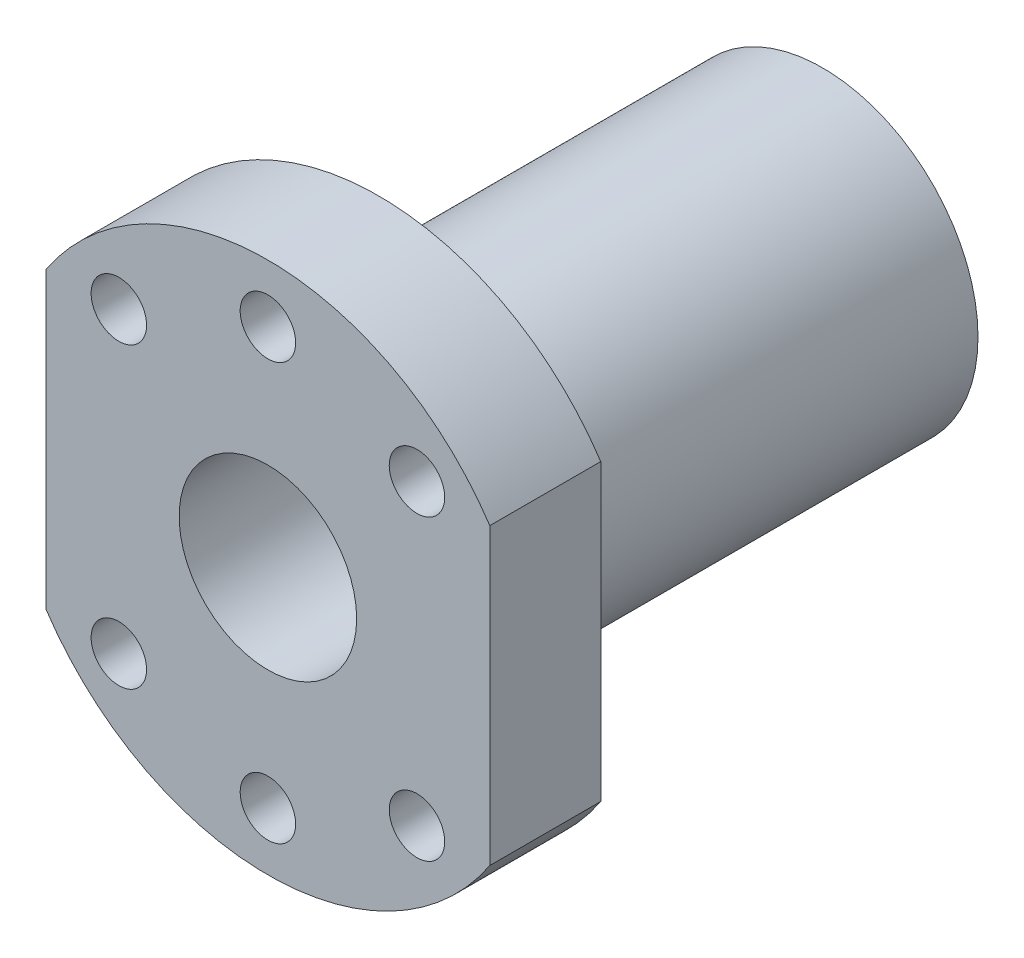
ISO-10303-21;
HEADER;
FILE_DESCRIPTION(('STEP AP214'),'2;1');
FILE_NAME('part.step','',(''),(''),'','','');
FILE_SCHEMA(('AUTOMOTIVE_DESIGN { 1 0 10303 214 1 1 1 1 }'));
ENDSEC;
DATA;
#1=APPLICATION_CONTEXT('core data for automotive mechanical design processes');
#2=APPLICATION_PROTOCOL_DEFINITION('international standard','automotive_design',2000,#1);
#3=PRODUCT_CONTEXT('',#1,'mechanical');
#4=PRODUCT('Part','Part','',(#3));
#5=PRODUCT_RELATED_PRODUCT_CATEGORY('part','',(#4));
#6=PRODUCT_DEFINITION_FORMATION('','',#4);
#7=PRODUCT_DEFINITION_CONTEXT('part definition',#1,'design');
#8=PRODUCT_DEFINITION('design','',#6,#7);
#9=PRODUCT_DEFINITION_SHAPE('','',#8);
#10=(LENGTH_UNIT() NAMED_UNIT(*) SI_UNIT(.MILLI.,.METRE.));
#11=(NAMED_UNIT(*) PLANE_ANGLE_UNIT() SI_UNIT($,.RADIAN.));
#12=(NAMED_UNIT(*) SI_UNIT($,.STERADIAN.) SOLID_ANGLE_UNIT());
#13=UNCERTAINTY_MEASURE_WITH_UNIT(LENGTH_MEASURE(1.E-05),#10,'distance_accuracy_value','');
#14=(GEOMETRIC_REPRESENTATION_CONTEXT(3) GLOBAL_UNCERTAINTY_ASSIGNED_CONTEXT((#13)) GLOBAL_UNIT_ASSIGNED_CONTEXT((#10,
#11,#12)) REPRESENTATION_CONTEXT('',''));
#15=CARTESIAN_POINT('',(0.,0.,0.));
#16=DIRECTION('',(0.,0.,1.));
#17=DIRECTION('',(1.,0.,0.));
#18=AXIS2_PLACEMENT_3D('',#15,#16,#17);
#19=CARTESIAN_POINT('',(0.,0.,-50.));
#20=DIRECTION('',(0.,0.,1.));
#21=DIRECTION('',(1.,0.,0.));
#22=AXIS2_PLACEMENT_3D('',#19,#20,#21);
#23=CYLINDRICAL_SURFACE('',#22,24.);
#24=DIRECTION('',(0.,0.,1.));
#25=VECTOR('',#24,1.);
#26=CARTESIAN_POINT('',(-20.,-13.2664991614216,-50.));
#27=LINE('',#26,#25);
#28=CARTESIAN_POINT('',(-20.,-13.2664991614216,-10.));
#29=VERTEX_POINT('',#28);
#30=CARTESIAN_POINT('',(-20.,-13.2664991614216,0.));
#31=VERTEX_POINT('',#30);
#32=EDGE_CURVE('E12',#29,#31,#27,.T.);
#33=ORIENTED_EDGE('',*,*,#32,.F.);
#34=CARTESIAN_POINT('',(0.,0.,-10.));
#35=DIRECTION('',(0.,0.,-1.));
#36=DIRECTION('',(-1.,0.,0.));
#37=AXIS2_PLACEMENT_3D('',#34,#35,#36);
#38=CIRCLE('',#37,24.);
#39=CARTESIAN_POINT('',(20.,-13.2664991614216,-10.));
#40=VERTEX_POINT('',#39);
#41=EDGE_CURVE('E78',#29,#40,#38,.F.);
#42=ORIENTED_EDGE('',*,*,#41,.T.);
#43=DIRECTION('',(0.,0.,1.));
#44=VECTOR('',#43,1.);
#45=CARTESIAN_POINT('',(20.,-13.2664991614216,-50.));
#46=LINE('',#45,#44);
#47=CARTESIAN_POINT('',(20.,-13.2664991614216,0.));
#48=VERTEX_POINT('',#47);
#49=EDGE_CURVE('E85',#40,#48,#46,.T.);
#50=ORIENTED_EDGE('',*,*,#49,.T.);
#51=CARTESIAN_POINT('',(0.,0.,0.));
#52=DIRECTION('',(0.,0.,1.));
#53=DIRECTION('',(1.,0.,0.));
#54=AXIS2_PLACEMENT_3D('',#51,#52,#53);
#55=CIRCLE('',#54,24.);
#56=EDGE_CURVE('E105',#31,#48,#55,.T.);
#57=ORIENTED_EDGE('',*,*,#56,.F.);
#58=EDGE_LOOP('',(#33,#42,#50,#57));
#59=FACE_BOUND('',#58,.T.);
#60=ADVANCED_FACE('F35',(#59),#23,.T.);
#61=CARTESIAN_POINT('',(-20.,-13.2664991614216,-50.));
#62=DIRECTION('',(-1.,0.,0.));
#63=DIRECTION('',(0.,0.,1.));
#64=AXIS2_PLACEMENT_3D('',#61,#62,#63);
#65=PLANE('',#64);
#66=DIRECTION('',(0.,0.,1.));
#67=VECTOR('',#66,1.);
#68=CARTESIAN_POINT('',(-20.,13.2664991614216,-50.));
#69=LINE('',#68,#67);
#70=CARTESIAN_POINT('',(-20.,13.2664991614216,-10.));
#71=VERTEX_POINT('',#70);
#72=CARTESIAN_POINT('',(-20.,13.2664991614216,0.));
#73=VERTEX_POINT('',#72);
#74=EDGE_CURVE('E43',#71,#73,#69,.T.);
#75=ORIENTED_EDGE('',*,*,#74,.F.);
#76=DIRECTION('',(0.,-1.,0.));
#77=VECTOR('',#76,1.);
#78=CARTESIAN_POINT('',(-20.,-13.2664991614216,-10.));
#79=LINE('',#78,#77);
#80=EDGE_CURVE('E88',#71,#29,#79,.T.);
#81=ORIENTED_EDGE('',*,*,#80,.T.);
#82=ORIENTED_EDGE('',*,*,#32,.T.);
#83=DIRECTION('',(0.,-1.,0.));
#84=VECTOR('',#83,1.);
#85=CARTESIAN_POINT('',(-20.,-13.2664991614216,0.));
#86=LINE('',#85,#84);
#87=EDGE_CURVE('E95',#73,#31,#86,.T.);
#88=ORIENTED_EDGE('',*,*,#87,.F.);
#89=EDGE_LOOP('',(#75,#81,#82,#88));
#90=FACE_BOUND('',#89,.T.);
#91=ADVANCED_FACE('F176',(#90),#65,.T.);
#92=CARTESIAN_POINT('',(0.,0.,-50.));
#93=DIRECTION('',(0.,0.,1.));
#94=DIRECTION('',(1.,0.,0.));
#95=AXIS2_PLACEMENT_3D('',#92,#93,#94);
#96=CYLINDRICAL_SURFACE('',#95,24.);
#97=DIRECTION('',(0.,0.,1.));
#98=VECTOR('',#97,1.);
#99=CARTESIAN_POINT('',(20.,13.2664991614216,-50.));
#100=LINE('',#99,#98);
#101=CARTESIAN_POINT('',(20.,13.2664991614216,-10.));
#102=VERTEX_POINT('',#101);
#103=CARTESIAN_POINT('',(20.,13.2664991614216,0.));
#104=VERTEX_POINT('',#103);
#105=EDGE_CURVE('E94',#102,#104,#100,.T.);
#106=ORIENTED_EDGE('',*,*,#105,.F.);
#107=CARTESIAN_POINT('',(0.,0.,-10.));
#108=DIRECTION('',(0.,0.,-1.));
#109=DIRECTION('',(-1.,0.,0.));
#110=AXIS2_PLACEMENT_3D('',#107,#108,#109);
#111=CIRCLE('',#110,24.);
#112=EDGE_CURVE('E51',#102,#71,#111,.F.);
#113=ORIENTED_EDGE('',*,*,#112,.T.);
#114=ORIENTED_EDGE('',*,*,#74,.T.);
#115=CARTESIAN_POINT('',(0.,0.,0.));
#116=DIRECTION('',(0.,0.,1.));
#117=DIRECTION('',(1.,0.,0.));
#118=AXIS2_PLACEMENT_3D('',#115,#116,#117);
#119=CIRCLE('',#118,24.);
#120=EDGE_CURVE('E98',#104,#73,#119,.T.);
#121=ORIENTED_EDGE('',*,*,#120,.F.);
#122=EDGE_LOOP('',(#106,#113,#114,#121));
#123=FACE_BOUND('',#122,.T.);
#124=ADVANCED_FACE('F180',(#123),#96,.T.);
#125=CARTESIAN_POINT('',(20.,-13.2664991614216,-50.));
#126=DIRECTION('',(1.,0.,0.));
#127=DIRECTION('',(0.,0.,-1.));
#128=AXIS2_PLACEMENT_3D('',#125,#126,#127);
#129=PLANE('',#128);
#130=ORIENTED_EDGE('',*,*,#49,.F.);
#131=DIRECTION('',(0.,1.,0.));
#132=VECTOR('',#131,1.);
#133=CARTESIAN_POINT('',(20.,-13.2664991614216,-10.));
#134=LINE('',#133,#132);
#135=EDGE_CURVE('E74',#40,#102,#134,.T.);
#136=ORIENTED_EDGE('',*,*,#135,.T.);
#137=ORIENTED_EDGE('',*,*,#105,.T.);
#138=DIRECTION('',(0.,1.,0.));
#139=VECTOR('',#138,1.);
#140=CARTESIAN_POINT('',(20.,-13.2664991614216,0.));
#141=LINE('',#140,#139);
#142=EDGE_CURVE('E92',#48,#104,#141,.T.);
#143=ORIENTED_EDGE('',*,*,#142,.F.);
#144=EDGE_LOOP('',(#130,#136,#137,#143));
#145=FACE_BOUND('',#144,.T.);
#146=ADVANCED_FACE('F90',(#145),#129,.T.);
#147=CARTESIAN_POINT('',(0.,0.,-50.));
#148=DIRECTION('',(0.,0.,1.));
#149=DIRECTION('',(1.,0.,0.));
#150=AXIS2_PLACEMENT_3D('',#147,#148,#149);
#151=PLANE('',#150);
#152=CARTESIAN_POINT('',(0.,0.,-50.));
#153=DIRECTION('',(0.,0.,1.));
#154=DIRECTION('',(1.,0.,0.));
#155=AXIS2_PLACEMENT_3D('',#152,#153,#154);
#156=CIRCLE('',#155,8.);
#157=CARTESIAN_POINT('',(8.,0.,-50.));
#158=VERTEX_POINT('',#157);
#159=EDGE_CURVE('E107',#158,#158,#156,.T.);
#160=ORIENTED_EDGE('',*,*,#159,.T.);
#161=EDGE_LOOP('',(#160));
#162=FACE_BOUND('',#161,.T.);
#163=CARTESIAN_POINT('',(0.,0.,-50.));
#164=DIRECTION('',(0.,0.,-1.));
#165=DIRECTION('',(-1.,0.,0.));
#166=AXIS2_PLACEMENT_3D('',#163,#164,#165);
#167=CIRCLE('',#166,14.);
#168=CARTESIAN_POINT('',(-14.,0.,-50.));
#169=VERTEX_POINT('',#168);
#170=EDGE_CURVE('E146',#169,#169,#167,.T.);
#171=ORIENTED_EDGE('',*,*,#170,.T.);
#172=EDGE_LOOP('',(#171));
#173=FACE_BOUND('',#172,.T.);
#174=ADVANCED_FACE('F190',(#162,#173),#151,.F.);
#175=CARTESIAN_POINT('',(-13.4350288425444,13.4350288425444,-50.));
#176=DIRECTION('',(0.,0.,1.));
#177=DIRECTION('',(1.,0.,0.));
#178=AXIS2_PLACEMENT_3D('',#175,#176,#177);
#179=CYLINDRICAL_SURFACE('',#178,2.5);
#180=CARTESIAN_POINT('',(-13.4350288425444,13.4350288425444,0.));
#181=DIRECTION('',(0.,0.,1.));
#182=DIRECTION('',(1.,0.,0.));
#183=AXIS2_PLACEMENT_3D('',#180,#181,#182);
#184=CIRCLE('',#183,2.5);
#185=CARTESIAN_POINT('',(-10.9350288425444,13.4350288425444,0.));
#186=VERTEX_POINT('',#185);
#187=EDGE_CURVE('E111',#186,#186,#184,.T.);
#188=ORIENTED_EDGE('',*,*,#187,.T.);
#189=EDGE_LOOP('',(#188));
#190=FACE_BOUND('',#189,.T.);
#191=CARTESIAN_POINT('',(-13.4350288425444,13.4350288425444,-10.));
#192=DIRECTION('',(0.,0.,-1.));
#193=DIRECTION('',(-1.,0.,0.));
#194=AXIS2_PLACEMENT_3D('',#191,#192,#193);
#195=CIRCLE('',#194,2.5);
#196=CARTESIAN_POINT('',(-15.9350288425444,13.4350288425444,-10.));
#197=VERTEX_POINT('',#196);
#198=EDGE_CURVE('E82',#197,#197,#195,.F.);
#199=ORIENTED_EDGE('',*,*,#198,.F.);
#200=EDGE_LOOP('',(#199));
#201=FACE_BOUND('',#200,.T.);
#202=ADVANCED_FACE('F194',(#190,#201),#179,.F.);
#203=CARTESIAN_POINT('',(13.4350288425444,13.4350288425444,-50.));
#204=DIRECTION('',(0.,0.,1.));
#205=DIRECTION('',(1.,0.,0.));
#206=AXIS2_PLACEMENT_3D('',#203,#204,#205);
#207=CYLINDRICAL_SURFACE('',#206,2.5);
#208=CARTESIAN_POINT('',(13.4350288425444,13.4350288425444,0.));
#209=DIRECTION('',(0.,0.,1.));
#210=DIRECTION('',(-1.,0.,0.));
#211=AXIS2_PLACEMENT_3D('',#208,#209,#210);
#212=CIRCLE('',#211,2.5);
#213=CARTESIAN_POINT('',(10.9350288425444,13.4350288425444,0.));
#214=VERTEX_POINT('',#213);
#215=EDGE_CURVE('E116',#214,#214,#212,.T.);
#216=ORIENTED_EDGE('',*,*,#215,.T.);
#217=EDGE_LOOP('',(#216));
#218=FACE_BOUND('',#217,.T.);
#219=CARTESIAN_POINT('',(13.4350288425444,13.4350288425444,-10.));
#220=DIRECTION('',(0.,0.,-1.));
#221=DIRECTION('',(-1.,0.,0.));
#222=AXIS2_PLACEMENT_3D('',#219,#220,#221);
#223=CIRCLE('',#222,2.5);
#224=CARTESIAN_POINT('',(10.9350288425444,13.4350288425444,-10.));
#225=VERTEX_POINT('',#224);
#226=EDGE_CURVE('E134',#225,#225,#223,.F.);
#227=ORIENTED_EDGE('',*,*,#226,.F.);
#228=EDGE_LOOP('',(#227));
#229=FACE_BOUND('',#228,.T.);
#230=ADVANCED_FACE('F199',(#218,#229),#207,.F.);
#231=CARTESIAN_POINT('',(13.4350288425444,-13.4350288425444,-50.));
#232=DIRECTION('',(0.,0.,1.));
#233=DIRECTION('',(1.,0.,0.));
#234=AXIS2_PLACEMENT_3D('',#231,#232,#233);
#235=CYLINDRICAL_SURFACE('',#234,2.5);
#236=CARTESIAN_POINT('',(13.4350288425444,-13.4350288425444,0.));
#237=DIRECTION('',(0.,0.,1.));
#238=DIRECTION('',(1.,0.,0.));
#239=AXIS2_PLACEMENT_3D('',#236,#237,#238);
#240=CIRCLE('',#239,2.5);
#241=CARTESIAN_POINT('',(15.9350288425444,-13.4350288425444,0.));
#242=VERTEX_POINT('',#241);
#243=EDGE_CURVE('E119',#242,#242,#240,.T.);
#244=ORIENTED_EDGE('',*,*,#243,.T.);
#245=EDGE_LOOP('',(#244));
#246=FACE_BOUND('',#245,.T.);
#247=CARTESIAN_POINT('',(13.4350288425444,-13.4350288425444,-10.));
#248=DIRECTION('',(0.,0.,-1.));
#249=DIRECTION('',(-1.,0.,0.));
#250=AXIS2_PLACEMENT_3D('',#247,#248,#249);
#251=CIRCLE('',#250,2.5);
#252=CARTESIAN_POINT('',(10.9350288425444,-13.4350288425444,-10.));
#253=VERTEX_POINT('',#252);
#254=EDGE_CURVE('E137',#253,#253,#251,.F.);
#255=ORIENTED_EDGE('',*,*,#254,.F.);
#256=EDGE_LOOP('',(#255));
#257=FACE_BOUND('',#256,.T.);
#258=ADVANCED_FACE('F209',(#246,#257),#235,.F.);
#259=CARTESIAN_POINT('',(-13.4350288425444,-13.4350288425444,-50.));
#260=DIRECTION('',(0.,0.,1.));
#261=DIRECTION('',(1.,0.,0.));
#262=AXIS2_PLACEMENT_3D('',#259,#260,#261);
#263=CYLINDRICAL_SURFACE('',#262,2.5);
#264=CARTESIAN_POINT('',(-13.4350288425444,-13.4350288425444,0.));
#265=DIRECTION('',(0.,0.,1.));
#266=DIRECTION('',(-1.,0.,0.));
#267=AXIS2_PLACEMENT_3D('',#264,#265,#266);
#268=CIRCLE('',#267,2.5);
#269=CARTESIAN_POINT('',(-15.9350288425444,-13.4350288425444,0.));
#270=VERTEX_POINT('',#269);
#271=EDGE_CURVE('E122',#270,#270,#268,.T.);
#272=ORIENTED_EDGE('',*,*,#271,.T.);
#273=EDGE_LOOP('',(#272));
#274=FACE_BOUND('',#273,.T.);
#275=CARTESIAN_POINT('',(-13.4350288425444,-13.4350288425444,-10.));
#276=DIRECTION('',(0.,0.,-1.));
#277=DIRECTION('',(-1.,0.,0.));
#278=AXIS2_PLACEMENT_3D('',#275,#276,#277);
#279=CIRCLE('',#278,2.5);
#280=CARTESIAN_POINT('',(-15.9350288425444,-13.4350288425444,-10.));
#281=VERTEX_POINT('',#280);
#282=EDGE_CURVE('E140',#281,#281,#279,.F.);
#283=ORIENTED_EDGE('',*,*,#282,.F.);
#284=EDGE_LOOP('',(#283));
#285=FACE_BOUND('',#284,.T.);
#286=ADVANCED_FACE('F171',(#274,#285),#263,.F.);
#287=CARTESIAN_POINT('',(0.,18.7818674114928,-50.));
#288=DIRECTION('',(0.,0.,1.));
#289=DIRECTION('',(1.,0.,0.));
#290=AXIS2_PLACEMENT_3D('',#287,#288,#289);
#291=CYLINDRICAL_SURFACE('',#290,2.5);
#292=CARTESIAN_POINT('',(0.,18.7818674114928,0.));
#293=DIRECTION('',(0.,0.,1.));
#294=DIRECTION('',(1.,0.,0.));
#295=AXIS2_PLACEMENT_3D('',#292,#293,#294);
#296=CIRCLE('',#295,2.5);
#297=CARTESIAN_POINT('',(2.5,18.7818674114928,0.));
#298=VERTEX_POINT('',#297);
#299=EDGE_CURVE('E125',#298,#298,#296,.T.);
#300=ORIENTED_EDGE('',*,*,#299,.T.);
#301=EDGE_LOOP('',(#300));
#302=FACE_BOUND('',#301,.T.);
#303=CARTESIAN_POINT('',(0.,18.7818674114928,-10.));
#304=DIRECTION('',(0.,0.,-1.));
#305=DIRECTION('',(-1.,0.,0.));
#306=AXIS2_PLACEMENT_3D('',#303,#304,#305);
#307=CIRCLE('',#306,2.5);
#308=CARTESIAN_POINT('',(-2.5,18.7818674114928,-10.));
#309=VERTEX_POINT('',#308);
#310=EDGE_CURVE('E143',#309,#309,#307,.F.);
#311=ORIENTED_EDGE('',*,*,#310,.F.);
#312=EDGE_LOOP('',(#311));
#313=FACE_BOUND('',#312,.T.);
#314=ADVANCED_FACE('F161',(#302,#313),#291,.F.);
#315=CARTESIAN_POINT('',(0.,-18.7818674114928,-50.));
#316=DIRECTION('',(0.,0.,1.));
#317=DIRECTION('',(1.,0.,0.));
#318=AXIS2_PLACEMENT_3D('',#315,#316,#317);
#319=CYLINDRICAL_SURFACE('',#318,2.5);
#320=CARTESIAN_POINT('',(0.,-18.7818674114928,0.));
#321=DIRECTION('',(0.,0.,1.));
#322=DIRECTION('',(-1.,0.,0.));
#323=AXIS2_PLACEMENT_3D('',#320,#321,#322);
#324=CIRCLE('',#323,2.5);
#325=CARTESIAN_POINT('',(-2.5,-18.7818674114928,0.));
#326=VERTEX_POINT('',#325);
#327=EDGE_CURVE('E87',#326,#326,#324,.T.);
#328=ORIENTED_EDGE('',*,*,#327,.T.);
#329=EDGE_LOOP('',(#328));
#330=FACE_BOUND('',#329,.T.);
#331=CARTESIAN_POINT('',(0.,-18.7818674114928,-10.));
#332=DIRECTION('',(0.,0.,-1.));
#333=DIRECTION('',(-1.,0.,0.));
#334=AXIS2_PLACEMENT_3D('',#331,#332,#333);
#335=CIRCLE('',#334,2.5);
#336=CARTESIAN_POINT('',(-2.5,-18.7818674114928,-10.));
#337=VERTEX_POINT('',#336);
#338=EDGE_CURVE('E38',#337,#337,#335,.F.);
#339=ORIENTED_EDGE('',*,*,#338,.F.);
#340=EDGE_LOOP('',(#339));
#341=FACE_BOUND('',#340,.T.);
#342=ADVANCED_FACE('F158',(#330,#341),#319,.F.);
#343=CARTESIAN_POINT('',(0.,0.,0.));
#344=DIRECTION('',(0.,0.,1.));
#345=DIRECTION('',(1.,0.,0.));
#346=AXIS2_PLACEMENT_3D('',#343,#344,#345);
#347=PLANE('',#346);
#348=ORIENTED_EDGE('',*,*,#327,.F.);
#349=EDGE_LOOP('',(#348));
#350=FACE_BOUND('',#349,.T.);
#351=ORIENTED_EDGE('',*,*,#299,.F.);
#352=EDGE_LOOP('',(#351));
#353=FACE_BOUND('',#352,.T.);
#354=ORIENTED_EDGE('',*,*,#271,.F.);
#355=EDGE_LOOP('',(#354));
#356=FACE_BOUND('',#355,.T.);
#357=ORIENTED_EDGE('',*,*,#243,.F.);
#358=EDGE_LOOP('',(#357));
#359=FACE_BOUND('',#358,.T.);
#360=ORIENTED_EDGE('',*,*,#215,.F.);
#361=EDGE_LOOP('',(#360));
#362=FACE_BOUND('',#361,.T.);
#363=ORIENTED_EDGE('',*,*,#187,.F.);
#364=EDGE_LOOP('',(#363));
#365=FACE_BOUND('',#364,.T.);
#366=CARTESIAN_POINT('',(0.,0.,0.));
#367=DIRECTION('',(0.,0.,1.));
#368=DIRECTION('',(1.,0.,0.));
#369=AXIS2_PLACEMENT_3D('',#366,#367,#368);
#370=CIRCLE('',#369,8.);
#371=CARTESIAN_POINT('',(8.,0.,0.));
#372=VERTEX_POINT('',#371);
#373=EDGE_CURVE('E108',#372,#372,#370,.T.);
#374=ORIENTED_EDGE('',*,*,#373,.F.);
#375=EDGE_LOOP('',(#374));
#376=FACE_BOUND('',#375,.T.);
#377=ORIENTED_EDGE('',*,*,#56,.T.);
#378=ORIENTED_EDGE('',*,*,#142,.T.);
#379=ORIENTED_EDGE('',*,*,#120,.T.);
#380=ORIENTED_EDGE('',*,*,#87,.T.);
#381=EDGE_LOOP('',(#377,#378,#379,#380));
#382=FACE_BOUND('',#381,.T.);
#383=ADVANCED_FACE('F160',(#350,#353,#356,#359,#362,#365,#376,#382),#347,.T.);
#384=CARTESIAN_POINT('',(0.,0.,-50.));
#385=DIRECTION('',(0.,0.,1.));
#386=DIRECTION('',(1.,0.,0.));
#387=AXIS2_PLACEMENT_3D('',#384,#385,#386);
#388=CYLINDRICAL_SURFACE('',#387,8.);
#389=ORIENTED_EDGE('',*,*,#159,.F.);
#390=EDGE_LOOP('',(#389));
#391=FACE_BOUND('',#390,.T.);
#392=ORIENTED_EDGE('',*,*,#373,.T.);
#393=EDGE_LOOP('',(#392));
#394=FACE_BOUND('',#393,.T.);
#395=ADVANCED_FACE('F168',(#391,#394),#388,.F.);
#396=CARTESIAN_POINT('',(0.,0.,-10.));
#397=DIRECTION('',(0.,0.,-1.));
#398=DIRECTION('',(-1.,0.,0.));
#399=AXIS2_PLACEMENT_3D('',#396,#397,#398);
#400=PLANE('',#399);
#401=ORIENTED_EDGE('',*,*,#80,.F.);
#402=ORIENTED_EDGE('',*,*,#112,.F.);
#403=ORIENTED_EDGE('',*,*,#135,.F.);
#404=ORIENTED_EDGE('',*,*,#41,.F.);
#405=EDGE_LOOP('',(#401,#402,#403,#404));
#406=FACE_BOUND('',#405,.T.);
#407=ORIENTED_EDGE('',*,*,#226,.T.);
#408=EDGE_LOOP('',(#407));
#409=FACE_BOUND('',#408,.T.);
#410=ORIENTED_EDGE('',*,*,#282,.T.);
#411=EDGE_LOOP('',(#410));
#412=FACE_BOUND('',#411,.T.);
#413=ORIENTED_EDGE('',*,*,#338,.T.);
#414=EDGE_LOOP('',(#413));
#415=FACE_BOUND('',#414,.T.);
#416=CARTESIAN_POINT('',(0.,0.,-10.));
#417=DIRECTION('',(0.,0.,-1.));
#418=DIRECTION('',(-1.,0.,0.));
#419=AXIS2_PLACEMENT_3D('',#416,#417,#418);
#420=CIRCLE('',#419,14.);
#421=CARTESIAN_POINT('',(-14.,0.,-10.));
#422=VERTEX_POINT('',#421);
#423=EDGE_CURVE('E149',#422,#422,#420,.T.);
#424=ORIENTED_EDGE('',*,*,#423,.F.);
#425=EDGE_LOOP('',(#424));
#426=FACE_BOUND('',#425,.T.);
#427=ORIENTED_EDGE('',*,*,#310,.T.);
#428=EDGE_LOOP('',(#427));
#429=FACE_BOUND('',#428,.T.);
#430=ORIENTED_EDGE('',*,*,#254,.T.);
#431=EDGE_LOOP('',(#430));
#432=FACE_BOUND('',#431,.T.);
#433=ORIENTED_EDGE('',*,*,#198,.T.);
#434=EDGE_LOOP('',(#433));
#435=FACE_BOUND('',#434,.T.);
#436=ADVANCED_FACE('F76',(#406,#409,#412,#415,#426,#429,#432,#435),#400,.T.);
#437=CARTESIAN_POINT('',(0.,0.,-10.));
#438=DIRECTION('',(0.,0.,-1.));
#439=DIRECTION('',(-1.,0.,0.));
#440=AXIS2_PLACEMENT_3D('',#437,#438,#439);
#441=CYLINDRICAL_SURFACE('',#440,14.);
#442=ORIENTED_EDGE('',*,*,#423,.T.);
#443=EDGE_LOOP('',(#442));
#444=FACE_BOUND('',#443,.T.);
#445=ORIENTED_EDGE('',*,*,#170,.F.);
#446=EDGE_LOOP('',(#445));
#447=FACE_BOUND('',#446,.T.);
#448=ADVANCED_FACE('F223',(#444,#447),#441,.T.);
#449=CLOSED_SHELL('',(#60,#91,#124,#146,#174,#202,#230,#258,#286,#314,#342,#383,#395,#436,#448));
#450=MANIFOLD_SOLID_BREP('B2',#449);
#451=ADVANCED_BREP_SHAPE_REPRESENTATION('',(#18,#450),#14);
#452=SHAPE_DEFINITION_REPRESENTATION(#9,#451);
ENDSEC;
END-ISO-10303-21;
